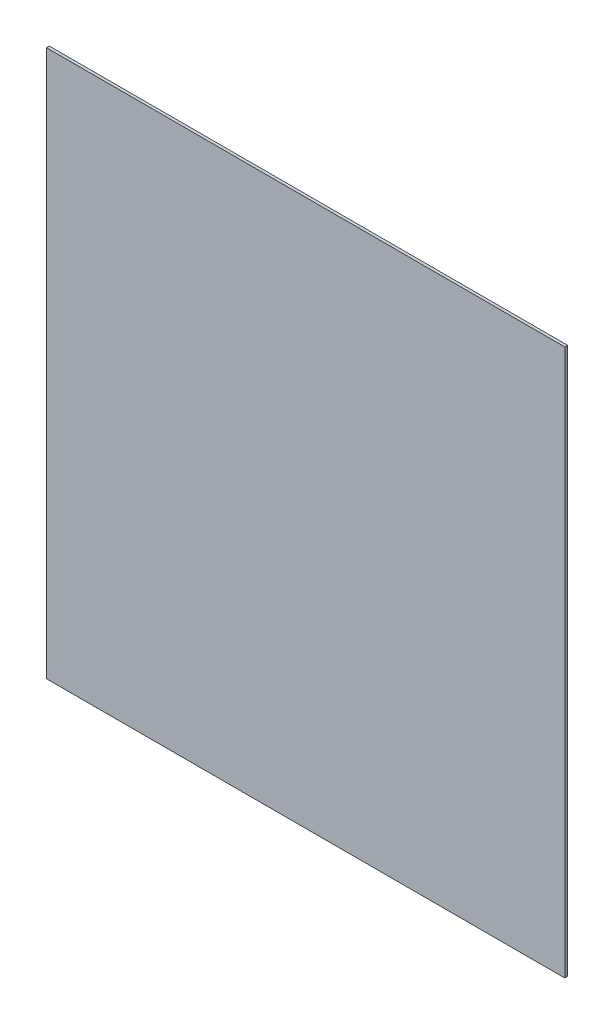
ISO-10303-21;
HEADER;
FILE_DESCRIPTION(('STEP AP214'),'2;1');
FILE_NAME('part.step','',(''),(''),'','','');
FILE_SCHEMA(('AUTOMOTIVE_DESIGN { 1 0 10303 214 1 1 1 1 }'));
ENDSEC;
DATA;
#1=APPLICATION_CONTEXT('core data for automotive mechanical design processes');
#2=APPLICATION_PROTOCOL_DEFINITION('international standard','automotive_design',2000,#1);
#3=PRODUCT_CONTEXT('',#1,'mechanical');
#4=PRODUCT('Part','Part','',(#3));
#5=PRODUCT_RELATED_PRODUCT_CATEGORY('part','',(#4));
#6=PRODUCT_DEFINITION_FORMATION('','',#4);
#7=PRODUCT_DEFINITION_CONTEXT('part definition',#1,'design');
#8=PRODUCT_DEFINITION('design','',#6,#7);
#9=PRODUCT_DEFINITION_SHAPE('','',#8);
#10=(LENGTH_UNIT() NAMED_UNIT(*) SI_UNIT(.MILLI.,.METRE.));
#11=(NAMED_UNIT(*) PLANE_ANGLE_UNIT() SI_UNIT($,.RADIAN.));
#12=(NAMED_UNIT(*) SI_UNIT($,.STERADIAN.) SOLID_ANGLE_UNIT());
#13=UNCERTAINTY_MEASURE_WITH_UNIT(LENGTH_MEASURE(1.E-05),#10,'distance_accuracy_value','');
#14=(GEOMETRIC_REPRESENTATION_CONTEXT(3) GLOBAL_UNCERTAINTY_ASSIGNED_CONTEXT((#13)) GLOBAL_UNIT_ASSIGNED_CONTEXT((#10,
#11,#12)) REPRESENTATION_CONTEXT('',''));
#15=CARTESIAN_POINT('',(0.,0.,0.));
#16=DIRECTION('',(0.,0.,1.));
#17=DIRECTION('',(1.,0.,0.));
#18=AXIS2_PLACEMENT_3D('',#15,#16,#17);
#19=CARTESIAN_POINT('',(184.,194.,0.));
#20=DIRECTION('',(0.,0.,1.));
#21=DIRECTION('',(1.,0.,0.));
#22=AXIS2_PLACEMENT_3D('',#19,#20,#21);
#23=PLANE('',#22);
#24=DIRECTION('',(0.,1.,0.));
#25=VECTOR('',#24,1.);
#26=CARTESIAN_POINT('',(0.,388.,0.));
#27=LINE('',#26,#25);
#28=CARTESIAN_POINT('',(0.,388.,0.));
#29=VERTEX_POINT('',#28);
#30=CARTESIAN_POINT('',(0.,0.,0.));
#31=VERTEX_POINT('',#30);
#32=EDGE_CURVE('E79',#29,#31,#27,.F.);
#33=ORIENTED_EDGE('',*,*,#32,.F.);
#34=DIRECTION('',(1.,0.,0.));
#35=VECTOR('',#34,1.);
#36=CARTESIAN_POINT('',(368.,388.,0.));
#37=LINE('',#36,#35);
#38=CARTESIAN_POINT('',(368.,388.,0.));
#39=VERTEX_POINT('',#38);
#40=EDGE_CURVE('E55',#39,#29,#37,.F.);
#41=ORIENTED_EDGE('',*,*,#40,.F.);
#42=DIRECTION('',(0.,1.,0.));
#43=VECTOR('',#42,1.);
#44=CARTESIAN_POINT('',(368.,0.,0.));
#45=LINE('',#44,#43);
#46=CARTESIAN_POINT('',(368.,0.,0.));
#47=VERTEX_POINT('',#46);
#48=EDGE_CURVE('E57',#47,#39,#45,.T.);
#49=ORIENTED_EDGE('',*,*,#48,.F.);
#50=DIRECTION('',(1.,0.,0.));
#51=VECTOR('',#50,1.);
#52=CARTESIAN_POINT('',(0.,0.,0.));
#53=LINE('',#52,#51);
#54=EDGE_CURVE('E20',#31,#47,#53,.T.);
#55=ORIENTED_EDGE('',*,*,#54,.F.);
#56=EDGE_LOOP('',(#33,#41,#49,#55));
#57=FACE_BOUND('',#56,.T.);
#58=ADVANCED_FACE('F17',(#57),#23,.F.);
#59=CARTESIAN_POINT('',(0.,0.,0.));
#60=DIRECTION('',(0.,-1.,0.));
#61=DIRECTION('',(0.,0.,-1.));
#62=AXIS2_PLACEMENT_3D('',#59,#60,#61);
#63=PLANE('',#62);
#64=DIRECTION('',(1.,0.,0.));
#65=VECTOR('',#64,1.);
#66=CARTESIAN_POINT('',(184.,0.,2.));
#67=LINE('',#66,#65);
#68=CARTESIAN_POINT('',(0.,0.,2.));
#69=VERTEX_POINT('',#68);
#70=CARTESIAN_POINT('',(368.,0.,2.));
#71=VERTEX_POINT('',#70);
#72=EDGE_CURVE('E83',#69,#71,#67,.T.);
#73=ORIENTED_EDGE('',*,*,#72,.F.);
#74=DIRECTION('',(0.,0.,1.));
#75=VECTOR('',#74,1.);
#76=CARTESIAN_POINT('',(0.,0.,0.));
#77=LINE('',#76,#75);
#78=EDGE_CURVE('E68',#31,#69,#77,.T.);
#79=ORIENTED_EDGE('',*,*,#78,.F.);
#80=ORIENTED_EDGE('',*,*,#54,.T.);
#81=DIRECTION('',(0.,0.,-1.));
#82=VECTOR('',#81,1.);
#83=CARTESIAN_POINT('',(368.,0.,0.));
#84=LINE('',#83,#82);
#85=EDGE_CURVE('E63',#71,#47,#84,.T.);
#86=ORIENTED_EDGE('',*,*,#85,.F.);
#87=EDGE_LOOP('',(#73,#79,#80,#86));
#88=FACE_BOUND('',#87,.T.);
#89=ADVANCED_FACE('F65',(#88),#63,.T.);
#90=CARTESIAN_POINT('',(368.,0.,0.));
#91=DIRECTION('',(1.,0.,0.));
#92=DIRECTION('',(0.,0.,-1.));
#93=AXIS2_PLACEMENT_3D('',#90,#91,#92);
#94=PLANE('',#93);
#95=DIRECTION('',(0.,1.,0.));
#96=VECTOR('',#95,1.);
#97=CARTESIAN_POINT('',(368.,194.,2.));
#98=LINE('',#97,#96);
#99=CARTESIAN_POINT('',(368.,388.,2.));
#100=VERTEX_POINT('',#99);
#101=EDGE_CURVE('E72',#71,#100,#98,.T.);
#102=ORIENTED_EDGE('',*,*,#101,.F.);
#103=ORIENTED_EDGE('',*,*,#85,.T.);
#104=ORIENTED_EDGE('',*,*,#48,.T.);
#105=DIRECTION('',(0.,0.,1.));
#106=VECTOR('',#105,1.);
#107=CARTESIAN_POINT('',(368.,388.,0.));
#108=LINE('',#107,#106);
#109=EDGE_CURVE('E75',#100,#39,#108,.F.);
#110=ORIENTED_EDGE('',*,*,#109,.F.);
#111=EDGE_LOOP('',(#102,#103,#104,#110));
#112=FACE_BOUND('',#111,.T.);
#113=ADVANCED_FACE('F70',(#112),#94,.T.);
#114=CARTESIAN_POINT('',(368.,388.,0.));
#115=DIRECTION('',(0.,1.,0.));
#116=DIRECTION('',(0.,0.,1.));
#117=AXIS2_PLACEMENT_3D('',#114,#115,#116);
#118=PLANE('',#117);
#119=DIRECTION('',(1.,0.,0.));
#120=VECTOR('',#119,1.);
#121=CARTESIAN_POINT('',(184.,388.,2.));
#122=LINE('',#121,#120);
#123=CARTESIAN_POINT('',(0.,388.,2.));
#124=VERTEX_POINT('',#123);
#125=EDGE_CURVE('E26',#100,#124,#122,.F.);
#126=ORIENTED_EDGE('',*,*,#125,.F.);
#127=ORIENTED_EDGE('',*,*,#109,.T.);
#128=ORIENTED_EDGE('',*,*,#40,.T.);
#129=DIRECTION('',(0.,0.,1.));
#130=VECTOR('',#129,1.);
#131=CARTESIAN_POINT('',(0.,388.,0.));
#132=LINE('',#131,#130);
#133=EDGE_CURVE('E35',#124,#29,#132,.F.);
#134=ORIENTED_EDGE('',*,*,#133,.F.);
#135=EDGE_LOOP('',(#126,#127,#128,#134));
#136=FACE_BOUND('',#135,.T.);
#137=ADVANCED_FACE('F89',(#136),#118,.T.);
#138=CARTESIAN_POINT('',(0.,388.,0.));
#139=DIRECTION('',(-1.,0.,0.));
#140=DIRECTION('',(0.,0.,1.));
#141=AXIS2_PLACEMENT_3D('',#138,#139,#140);
#142=PLANE('',#141);
#143=DIRECTION('',(0.,1.,0.));
#144=VECTOR('',#143,1.);
#145=CARTESIAN_POINT('',(0.,194.,2.));
#146=LINE('',#145,#144);
#147=EDGE_CURVE('E11',#124,#69,#146,.F.);
#148=ORIENTED_EDGE('',*,*,#147,.F.);
#149=ORIENTED_EDGE('',*,*,#133,.T.);
#150=ORIENTED_EDGE('',*,*,#32,.T.);
#151=ORIENTED_EDGE('',*,*,#78,.T.);
#152=EDGE_LOOP('',(#148,#149,#150,#151));
#153=FACE_BOUND('',#152,.T.);
#154=ADVANCED_FACE('F91',(#153),#142,.T.);
#155=CARTESIAN_POINT('',(184.,194.,2.));
#156=DIRECTION('',(0.,0.,1.));
#157=DIRECTION('',(1.,0.,0.));
#158=AXIS2_PLACEMENT_3D('',#155,#156,#157);
#159=PLANE('',#158);
#160=ORIENTED_EDGE('',*,*,#125,.T.);
#161=ORIENTED_EDGE('',*,*,#147,.T.);
#162=ORIENTED_EDGE('',*,*,#72,.T.);
#163=ORIENTED_EDGE('',*,*,#101,.T.);
#164=EDGE_LOOP('',(#160,#161,#162,#163));
#165=FACE_BOUND('',#164,.T.);
#166=ADVANCED_FACE('F88',(#165),#159,.T.);
#167=CLOSED_SHELL('',(#58,#89,#113,#137,#154,#166));
#168=MANIFOLD_SOLID_BREP('B1',#167);
#169=ADVANCED_BREP_SHAPE_REPRESENTATION('',(#18,#168),#14);
#170=SHAPE_DEFINITION_REPRESENTATION(#9,#169);
ENDSEC;
END-ISO-10303-21;
